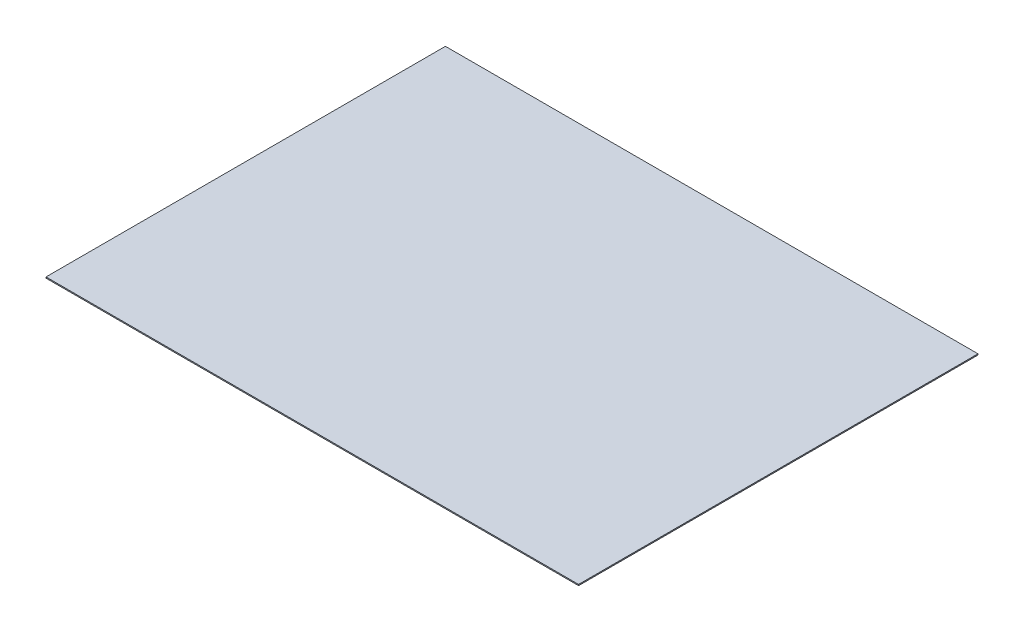
ISO-10303-21;
HEADER;
FILE_DESCRIPTION(('STEP AP214'),'2;1');
FILE_NAME('part.step','',(''),(''),'','','');
FILE_SCHEMA(('AUTOMOTIVE_DESIGN { 1 0 10303 214 1 1 1 1 }'));
ENDSEC;
DATA;
#1=APPLICATION_CONTEXT('core data for automotive mechanical design processes');
#2=APPLICATION_PROTOCOL_DEFINITION('international standard','automotive_design',2000,#1);
#3=PRODUCT_CONTEXT('',#1,'mechanical');
#4=PRODUCT('Part','Part','',(#3));
#5=PRODUCT_RELATED_PRODUCT_CATEGORY('part','',(#4));
#6=PRODUCT_DEFINITION_FORMATION('','',#4);
#7=PRODUCT_DEFINITION_CONTEXT('part definition',#1,'design');
#8=PRODUCT_DEFINITION('design','',#6,#7);
#9=PRODUCT_DEFINITION_SHAPE('','',#8);
#10=(LENGTH_UNIT() NAMED_UNIT(*) SI_UNIT(.MILLI.,.METRE.));
#11=(NAMED_UNIT(*) PLANE_ANGLE_UNIT() SI_UNIT($,.RADIAN.));
#12=(NAMED_UNIT(*) SI_UNIT($,.STERADIAN.) SOLID_ANGLE_UNIT());
#13=UNCERTAINTY_MEASURE_WITH_UNIT(LENGTH_MEASURE(1.E-05),#10,'distance_accuracy_value','');
#14=(GEOMETRIC_REPRESENTATION_CONTEXT(3) GLOBAL_UNCERTAINTY_ASSIGNED_CONTEXT((#13)) GLOBAL_UNIT_ASSIGNED_CONTEXT((#10,
#11,#12)) REPRESENTATION_CONTEXT('',''));
#15=CARTESIAN_POINT('',(0.,0.,0.));
#16=DIRECTION('',(0.,0.,1.));
#17=DIRECTION('',(1.,0.,0.));
#18=AXIS2_PLACEMENT_3D('',#15,#16,#17);
#19=CARTESIAN_POINT('',(0.,2.54,0.));
#20=DIRECTION('',(1.,0.,0.));
#21=DIRECTION('',(0.,0.,-1.));
#22=AXIS2_PLACEMENT_3D('',#19,#20,#21);
#23=PLANE('',#22);
#24=DIRECTION('',(0.,0.,1.));
#25=VECTOR('',#24,1.);
#26=CARTESIAN_POINT('',(0.,0.,0.));
#27=LINE('',#26,#25);
#28=CARTESIAN_POINT('',(0.,0.,-914.4));
#29=VERTEX_POINT('',#28);
#30=CARTESIAN_POINT('',(0.,0.,0.));
#31=VERTEX_POINT('',#30);
#32=EDGE_CURVE('E95',#29,#31,#27,.T.);
#33=ORIENTED_EDGE('',*,*,#32,.T.);
#34=DIRECTION('',(0.,-1.,0.));
#35=VECTOR('',#34,1.);
#36=CARTESIAN_POINT('',(0.,2.54,0.));
#37=LINE('',#36,#35);
#38=CARTESIAN_POINT('',(0.,2.54,0.));
#39=VERTEX_POINT('',#38);
#40=EDGE_CURVE('E11',#39,#31,#37,.T.);
#41=ORIENTED_EDGE('',*,*,#40,.F.);
#42=DIRECTION('',(0.,0.,1.));
#43=VECTOR('',#42,1.);
#44=CARTESIAN_POINT('',(0.,2.54,0.));
#45=LINE('',#44,#43);
#46=CARTESIAN_POINT('',(0.,2.54,-914.4));
#47=VERTEX_POINT('',#46);
#48=EDGE_CURVE('E83',#47,#39,#45,.T.);
#49=ORIENTED_EDGE('',*,*,#48,.F.);
#50=DIRECTION('',(0.,-1.,0.));
#51=VECTOR('',#50,1.);
#52=CARTESIAN_POINT('',(0.,2.54,-914.4));
#53=LINE('',#52,#51);
#54=EDGE_CURVE('E91',#47,#29,#53,.T.);
#55=ORIENTED_EDGE('',*,*,#54,.T.);
#56=EDGE_LOOP('',(#33,#41,#49,#55));
#57=FACE_BOUND('',#56,.T.);
#58=ADVANCED_FACE('F32',(#57),#23,.F.);
#59=CARTESIAN_POINT('',(0.,2.54,0.));
#60=DIRECTION('',(0.,0.,-1.));
#61=DIRECTION('',(-1.,0.,0.));
#62=AXIS2_PLACEMENT_3D('',#59,#60,#61);
#63=PLANE('',#62);
#64=DIRECTION('',(1.,0.,0.));
#65=VECTOR('',#64,1.);
#66=CARTESIAN_POINT('',(0.,0.,0.));
#67=LINE('',#66,#65);
#68=CARTESIAN_POINT('',(1219.2,0.,0.));
#69=VERTEX_POINT('',#68);
#70=EDGE_CURVE('E87',#31,#69,#67,.T.);
#71=ORIENTED_EDGE('',*,*,#70,.T.);
#72=DIRECTION('',(0.,-1.,0.));
#73=VECTOR('',#72,1.);
#74=CARTESIAN_POINT('',(1219.2,2.54,0.));
#75=LINE('',#74,#73);
#76=CARTESIAN_POINT('',(1219.2,2.54,0.));
#77=VERTEX_POINT('',#76);
#78=EDGE_CURVE('E40',#77,#69,#75,.T.);
#79=ORIENTED_EDGE('',*,*,#78,.F.);
#80=DIRECTION('',(1.,0.,0.));
#81=VECTOR('',#80,1.);
#82=CARTESIAN_POINT('',(0.,2.54,0.));
#83=LINE('',#82,#81);
#84=EDGE_CURVE('E78',#39,#77,#83,.T.);
#85=ORIENTED_EDGE('',*,*,#84,.F.);
#86=ORIENTED_EDGE('',*,*,#40,.T.);
#87=EDGE_LOOP('',(#71,#79,#85,#86));
#88=FACE_BOUND('',#87,.T.);
#89=ADVANCED_FACE('F86',(#88),#63,.F.);
#90=CARTESIAN_POINT('',(1219.2,2.54,0.));
#91=DIRECTION('',(-1.,0.,0.));
#92=DIRECTION('',(0.,0.,1.));
#93=AXIS2_PLACEMENT_3D('',#90,#91,#92);
#94=PLANE('',#93);
#95=DIRECTION('',(0.,0.,-1.));
#96=VECTOR('',#95,1.);
#97=CARTESIAN_POINT('',(1219.2,0.,0.));
#98=LINE('',#97,#96);
#99=CARTESIAN_POINT('',(1219.2,0.,-914.4));
#100=VERTEX_POINT('',#99);
#101=EDGE_CURVE('E65',#69,#100,#98,.T.);
#102=ORIENTED_EDGE('',*,*,#101,.T.);
#103=DIRECTION('',(0.,-1.,0.));
#104=VECTOR('',#103,1.);
#105=CARTESIAN_POINT('',(1219.2,2.54,-914.4));
#106=LINE('',#105,#104);
#107=CARTESIAN_POINT('',(1219.2,2.54,-914.4));
#108=VERTEX_POINT('',#107);
#109=EDGE_CURVE('E88',#108,#100,#106,.T.);
#110=ORIENTED_EDGE('',*,*,#109,.F.);
#111=DIRECTION('',(0.,0.,-1.));
#112=VECTOR('',#111,1.);
#113=CARTESIAN_POINT('',(1219.2,2.54,0.));
#114=LINE('',#113,#112);
#115=EDGE_CURVE('E81',#77,#108,#114,.T.);
#116=ORIENTED_EDGE('',*,*,#115,.F.);
#117=ORIENTED_EDGE('',*,*,#78,.T.);
#118=EDGE_LOOP('',(#102,#110,#116,#117));
#119=FACE_BOUND('',#118,.T.);
#120=ADVANCED_FACE('F89',(#119),#94,.F.);
#121=CARTESIAN_POINT('',(0.,2.54,-914.4));
#122=DIRECTION('',(0.,0.,1.));
#123=DIRECTION('',(1.,0.,0.));
#124=AXIS2_PLACEMENT_3D('',#121,#122,#123);
#125=PLANE('',#124);
#126=DIRECTION('',(-1.,0.,0.));
#127=VECTOR('',#126,1.);
#128=CARTESIAN_POINT('',(0.,0.,-914.4));
#129=LINE('',#128,#127);
#130=EDGE_CURVE('E71',#100,#29,#129,.T.);
#131=ORIENTED_EDGE('',*,*,#130,.T.);
#132=ORIENTED_EDGE('',*,*,#54,.F.);
#133=DIRECTION('',(-1.,0.,0.));
#134=VECTOR('',#133,1.);
#135=CARTESIAN_POINT('',(0.,2.54,-914.4));
#136=LINE('',#135,#134);
#137=EDGE_CURVE('E48',#108,#47,#136,.T.);
#138=ORIENTED_EDGE('',*,*,#137,.F.);
#139=ORIENTED_EDGE('',*,*,#109,.T.);
#140=EDGE_LOOP('',(#131,#132,#138,#139));
#141=FACE_BOUND('',#140,.T.);
#142=ADVANCED_FACE('F102',(#141),#125,.F.);
#143=CARTESIAN_POINT('',(0.,2.54,0.));
#144=DIRECTION('',(0.,-1.,0.));
#145=DIRECTION('',(0.,0.,-1.));
#146=AXIS2_PLACEMENT_3D('',#143,#144,#145);
#147=PLANE('',#146);
#148=ORIENTED_EDGE('',*,*,#48,.T.);
#149=ORIENTED_EDGE('',*,*,#84,.T.);
#150=ORIENTED_EDGE('',*,*,#115,.T.);
#151=ORIENTED_EDGE('',*,*,#137,.T.);
#152=EDGE_LOOP('',(#148,#149,#150,#151));
#153=FACE_BOUND('',#152,.T.);
#154=ADVANCED_FACE('F79',(#153),#147,.F.);
#155=CARTESIAN_POINT('',(0.,0.,0.));
#156=DIRECTION('',(0.,-1.,0.));
#157=DIRECTION('',(0.,0.,-1.));
#158=AXIS2_PLACEMENT_3D('',#155,#156,#157);
#159=PLANE('',#158);
#160=ORIENTED_EDGE('',*,*,#32,.F.);
#161=ORIENTED_EDGE('',*,*,#130,.F.);
#162=ORIENTED_EDGE('',*,*,#101,.F.);
#163=ORIENTED_EDGE('',*,*,#70,.F.);
#164=EDGE_LOOP('',(#160,#161,#162,#163));
#165=FACE_BOUND('',#164,.T.);
#166=ADVANCED_FACE('F105',(#165),#159,.T.);
#167=CLOSED_SHELL('',(#58,#89,#120,#142,#154,#166));
#168=MANIFOLD_SOLID_BREP('B2',#167);
#169=ADVANCED_BREP_SHAPE_REPRESENTATION('',(#18,#168),#14);
#170=SHAPE_DEFINITION_REPRESENTATION(#9,#169);
ENDSEC;
END-ISO-10303-21;
